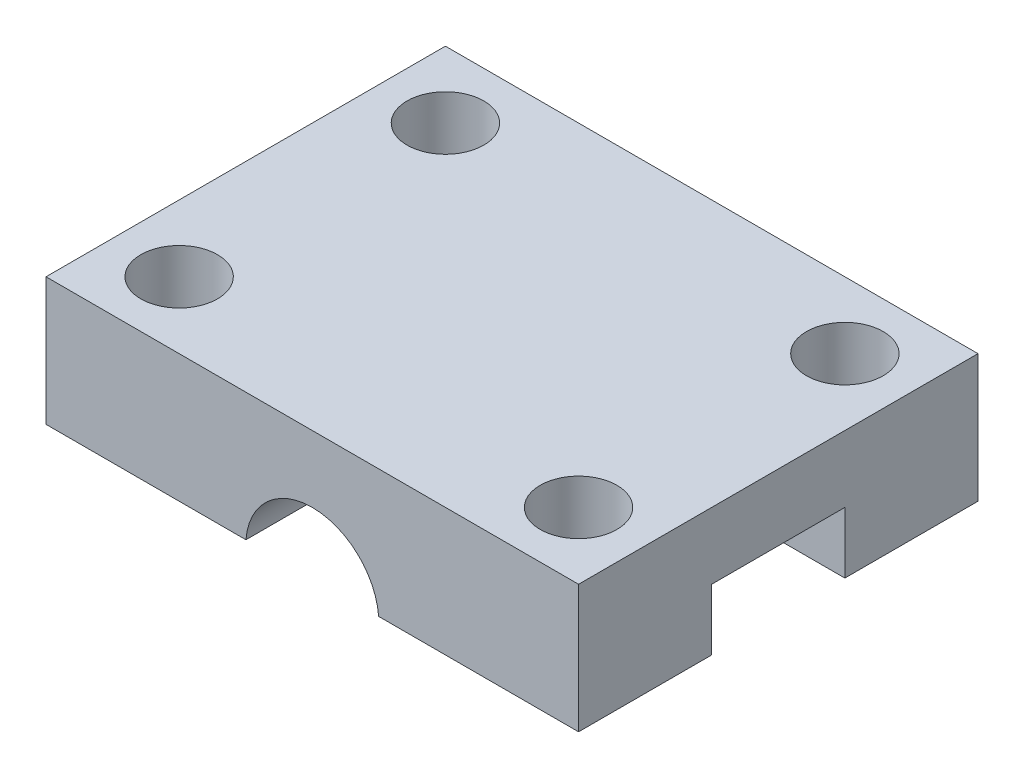
ISO-10303-21;
HEADER;
FILE_DESCRIPTION(('STEP AP214'),'2;1');
FILE_NAME('part.step','',(''),(''),'','','');
FILE_SCHEMA(('AUTOMOTIVE_DESIGN { 1 0 10303 214 1 1 1 1 }'));
ENDSEC;
DATA;
#1=APPLICATION_CONTEXT('core data for automotive mechanical design processes');
#2=APPLICATION_PROTOCOL_DEFINITION('international standard','automotive_design',2000,#1);
#3=PRODUCT_CONTEXT('',#1,'mechanical');
#4=PRODUCT('Part','Part','',(#3));
#5=PRODUCT_RELATED_PRODUCT_CATEGORY('part','',(#4));
#6=PRODUCT_DEFINITION_FORMATION('','',#4);
#7=PRODUCT_DEFINITION_CONTEXT('part definition',#1,'design');
#8=PRODUCT_DEFINITION('design','',#6,#7);
#9=PRODUCT_DEFINITION_SHAPE('','',#8);
#10=(LENGTH_UNIT() NAMED_UNIT(*) SI_UNIT(.MILLI.,.METRE.));
#11=(NAMED_UNIT(*) PLANE_ANGLE_UNIT() SI_UNIT($,.RADIAN.));
#12=(NAMED_UNIT(*) SI_UNIT($,.STERADIAN.) SOLID_ANGLE_UNIT());
#13=UNCERTAINTY_MEASURE_WITH_UNIT(LENGTH_MEASURE(1.E-05),#10,'distance_accuracy_value','');
#14=(GEOMETRIC_REPRESENTATION_CONTEXT(3) GLOBAL_UNCERTAINTY_ASSIGNED_CONTEXT((#13)) GLOBAL_UNIT_ASSIGNED_CONTEXT((#10,
#11,#12)) REPRESENTATION_CONTEXT('',''));
#15=CARTESIAN_POINT('',(0.,0.,0.));
#16=DIRECTION('',(0.,0.,1.));
#17=DIRECTION('',(1.,0.,0.));
#18=AXIS2_PLACEMENT_3D('',#15,#16,#17);
#19=CARTESIAN_POINT('',(25.4,0.,-12.7));
#20=DIRECTION('',(0.,0.,1.));
#21=DIRECTION('',(0.,-1.,0.));
#22=AXIS2_PLACEMENT_3D('',#19,#20,#21);
#23=PLANE('',#22);
#24=CARTESIAN_POINT('',(12.7,-0.254000000000003,-12.7));
#25=DIRECTION('',(0.,0.,1.));
#26=DIRECTION('',(0.,-1.,0.));
#27=AXIS2_PLACEMENT_3D('',#24,#25,#26);
#28=CIRCLE('',#27,3.175);
#29=CARTESIAN_POINT('',(15.8648236917718,0.,-12.7));
#30=VERTEX_POINT('',#29);
#31=CARTESIAN_POINT('',(12.7,2.921,-12.7));
#32=VERTEX_POINT('',#31);
#33=EDGE_CURVE('E157',#30,#32,#28,.T.);
#34=ORIENTED_EDGE('',*,*,#33,.F.);
#35=DIRECTION('',(-1.,0.,0.));
#36=VECTOR('',#35,1.);
#37=CARTESIAN_POINT('',(25.4,0.,-12.7));
#38=LINE('',#37,#36);
#39=CARTESIAN_POINT('',(25.4,0.,-12.7));
#40=VERTEX_POINT('',#39);
#41=EDGE_CURVE('E13',#40,#30,#38,.T.);
#42=ORIENTED_EDGE('',*,*,#41,.F.);
#43=DIRECTION('',(0.,1.,0.));
#44=VECTOR('',#43,1.);
#45=CARTESIAN_POINT('',(25.4,0.,-12.7));
#46=LINE('',#45,#44);
#47=CARTESIAN_POINT('',(25.4,2.921,-12.7));
#48=VERTEX_POINT('',#47);
#49=EDGE_CURVE('E188',#40,#48,#46,.T.);
#50=ORIENTED_EDGE('',*,*,#49,.T.);
#51=DIRECTION('',(-1.,0.,0.));
#52=VECTOR('',#51,1.);
#53=CARTESIAN_POINT('',(25.4,2.921,-12.7));
#54=LINE('',#53,#52);
#55=EDGE_CURVE('E181',#48,#32,#54,.T.);
#56=ORIENTED_EDGE('',*,*,#55,.T.);
#57=EDGE_LOOP('',(#34,#42,#50,#56));
#58=FACE_BOUND('',#57,.T.);
#59=ADVANCED_FACE('F48',(#58),#23,.T.);
#60=CARTESIAN_POINT('',(25.4,0.,0.));
#61=DIRECTION('',(0.,1.,0.));
#62=DIRECTION('',(0.,0.,1.));
#63=AXIS2_PLACEMENT_3D('',#60,#61,#62);
#64=PLANE('',#63);
#65=CARTESIAN_POINT('',(3.175,0.,-15.875));
#66=DIRECTION('',(0.,-1.,0.));
#67=DIRECTION('',(0.,0.,-1.));
#68=AXIS2_PLACEMENT_3D('',#65,#66,#67);
#69=CIRCLE('',#68,1.82879999999999);
#70=CARTESIAN_POINT('',(3.175,0.,-17.7038));
#71=VERTEX_POINT('',#70);
#72=EDGE_CURVE('E242',#71,#71,#69,.T.);
#73=ORIENTED_EDGE('',*,*,#72,.F.);
#74=EDGE_LOOP('',(#73));
#75=FACE_BOUND('',#74,.T.);
#76=DIRECTION('',(-1.,0.,0.));
#77=VECTOR('',#76,1.);
#78=CARTESIAN_POINT('',(25.4,0.,-19.05));
#79=LINE('',#78,#77);
#80=CARTESIAN_POINT('',(9.53517630822821,0.,-19.05));
#81=VERTEX_POINT('',#80);
#82=CARTESIAN_POINT('',(0.,0.,-19.05));
#83=VERTEX_POINT('',#82);
#84=EDGE_CURVE('E163',#81,#83,#79,.T.);
#85=ORIENTED_EDGE('',*,*,#84,.F.);
#86=DIRECTION('',(0.,0.,1.));
#87=VECTOR('',#86,1.);
#88=CARTESIAN_POINT('',(9.53517630822821,0.,-19.05));
#89=LINE('',#88,#87);
#90=CARTESIAN_POINT('',(9.53517630822821,0.,-12.7));
#91=VERTEX_POINT('',#90);
#92=EDGE_CURVE('E63',#81,#91,#89,.T.);
#93=ORIENTED_EDGE('',*,*,#92,.T.);
#94=CARTESIAN_POINT('',(0.,0.,-12.7));
#95=VERTEX_POINT('',#94);
#96=EDGE_CURVE('E56',#91,#95,#38,.T.);
#97=ORIENTED_EDGE('',*,*,#96,.T.);
#98=DIRECTION('',(0.,0.,-1.));
#99=VECTOR('',#98,1.);
#100=CARTESIAN_POINT('',(0.,0.,0.));
#101=LINE('',#100,#99);
#102=EDGE_CURVE('E202',#95,#83,#101,.T.);
#103=ORIENTED_EDGE('',*,*,#102,.T.);
#104=EDGE_LOOP('',(#85,#93,#97,#103));
#105=FACE_BOUND('',#104,.T.);
#106=ADVANCED_FACE('F288',(#75,#105),#64,.F.);
#107=CARTESIAN_POINT('',(3.175,0.,-3.175));
#108=DIRECTION('',(0.,-1.,0.));
#109=DIRECTION('',(0.,0.,-1.));
#110=AXIS2_PLACEMENT_3D('',#107,#108,#109);
#111=CIRCLE('',#110,1.8288);
#112=CARTESIAN_POINT('',(3.175,0.,-5.0038));
#113=VERTEX_POINT('',#112);
#114=EDGE_CURVE('E236',#113,#113,#111,.T.);
#115=ORIENTED_EDGE('',*,*,#114,.F.);
#116=EDGE_LOOP('',(#115));
#117=FACE_BOUND('',#116,.T.);
#118=DIRECTION('',(-1.,0.,0.));
#119=VECTOR('',#118,1.);
#120=CARTESIAN_POINT('',(25.4,0.,-6.35));
#121=LINE('',#120,#119);
#122=CARTESIAN_POINT('',(9.53517630822821,0.,-6.35));
#123=VERTEX_POINT('',#122);
#124=CARTESIAN_POINT('',(0.,0.,-6.35));
#125=VERTEX_POINT('',#124);
#126=EDGE_CURVE('E176',#123,#125,#121,.T.);
#127=ORIENTED_EDGE('',*,*,#126,.F.);
#128=DIRECTION('',(0.,0.,1.));
#129=VECTOR('',#128,1.);
#130=CARTESIAN_POINT('',(9.53517630822821,0.,-19.05));
#131=LINE('',#130,#129);
#132=CARTESIAN_POINT('',(9.53517630822821,0.,0.));
#133=VERTEX_POINT('',#132);
#134=EDGE_CURVE('E71',#123,#133,#131,.T.);
#135=ORIENTED_EDGE('',*,*,#134,.T.);
#136=DIRECTION('',(-1.,0.,0.));
#137=VECTOR('',#136,1.);
#138=CARTESIAN_POINT('',(25.4,0.,0.));
#139=LINE('',#138,#137);
#140=CARTESIAN_POINT('',(0.,0.,0.));
#141=VERTEX_POINT('',#140);
#142=EDGE_CURVE('E172',#133,#141,#139,.T.);
#143=ORIENTED_EDGE('',*,*,#142,.T.);
#144=EDGE_CURVE('E192',#141,#125,#101,.T.);
#145=ORIENTED_EDGE('',*,*,#144,.T.);
#146=EDGE_LOOP('',(#127,#135,#143,#145));
#147=FACE_BOUND('',#146,.T.);
#148=ADVANCED_FACE('F273',(#117,#147),#64,.F.);
#149=CARTESIAN_POINT('',(25.4,0.,-6.35));
#150=DIRECTION('',(0.,0.,-1.));
#151=DIRECTION('',(0.,1.,0.));
#152=AXIS2_PLACEMENT_3D('',#149,#150,#151);
#153=PLANE('',#152);
#154=CARTESIAN_POINT('',(12.7,-0.254000000000003,-6.35));
#155=DIRECTION('',(0.,0.,-1.));
#156=DIRECTION('',(0.,1.,0.));
#157=AXIS2_PLACEMENT_3D('',#154,#155,#156);
#158=CIRCLE('',#157,3.175);
#159=CARTESIAN_POINT('',(12.7,2.921,-6.35));
#160=VERTEX_POINT('',#159);
#161=CARTESIAN_POINT('',(15.8648236917718,0.,-6.35));
#162=VERTEX_POINT('',#161);
#163=EDGE_CURVE('E228',#160,#162,#158,.T.);
#164=ORIENTED_EDGE('',*,*,#163,.F.);
#165=DIRECTION('',(-1.,0.,0.));
#166=VECTOR('',#165,1.);
#167=CARTESIAN_POINT('',(25.4,2.921,-6.35));
#168=LINE('',#167,#166);
#169=CARTESIAN_POINT('',(25.4,2.921,-6.35));
#170=VERTEX_POINT('',#169);
#171=EDGE_CURVE('E177',#170,#160,#168,.T.);
#172=ORIENTED_EDGE('',*,*,#171,.F.);
#173=DIRECTION('',(0.,-1.,0.));
#174=VECTOR('',#173,1.);
#175=CARTESIAN_POINT('',(25.4,0.,-6.35));
#176=LINE('',#175,#174);
#177=CARTESIAN_POINT('',(25.4,0.,-6.35));
#178=VERTEX_POINT('',#177);
#179=EDGE_CURVE('E211',#170,#178,#176,.T.);
#180=ORIENTED_EDGE('',*,*,#179,.T.);
#181=EDGE_CURVE('E173',#178,#162,#121,.T.);
#182=ORIENTED_EDGE('',*,*,#181,.T.);
#183=EDGE_LOOP('',(#164,#172,#180,#182));
#184=FACE_BOUND('',#183,.T.);
#185=ADVANCED_FACE('F280',(#184),#153,.T.);
#186=EDGE_CURVE('E230',#32,#91,#28,.T.);
#187=ORIENTED_EDGE('',*,*,#186,.F.);
#188=CARTESIAN_POINT('',(0.,2.921,-12.7));
#189=VERTEX_POINT('',#188);
#190=EDGE_CURVE('E184',#32,#189,#54,.T.);
#191=ORIENTED_EDGE('',*,*,#190,.T.);
#192=DIRECTION('',(0.,1.,0.));
#193=VECTOR('',#192,1.);
#194=CARTESIAN_POINT('',(0.,0.,-12.7));
#195=LINE('',#194,#193);
#196=EDGE_CURVE('E205',#95,#189,#195,.T.);
#197=ORIENTED_EDGE('',*,*,#196,.F.);
#198=ORIENTED_EDGE('',*,*,#96,.F.);
#199=EDGE_LOOP('',(#187,#191,#197,#198));
#200=FACE_BOUND('',#199,.T.);
#201=ADVANCED_FACE('F50',(#200),#23,.T.);
#202=CARTESIAN_POINT('',(22.225,0.,-15.875));
#203=DIRECTION('',(0.,-1.,0.));
#204=DIRECTION('',(0.,0.,-1.));
#205=AXIS2_PLACEMENT_3D('',#202,#203,#204);
#206=CIRCLE('',#205,1.8288);
#207=CARTESIAN_POINT('',(22.225,0.,-17.7038));
#208=VERTEX_POINT('',#207);
#209=EDGE_CURVE('E254',#208,#208,#206,.T.);
#210=ORIENTED_EDGE('',*,*,#209,.F.);
#211=EDGE_LOOP('',(#210));
#212=FACE_BOUND('',#211,.T.);
#213=ORIENTED_EDGE('',*,*,#41,.T.);
#214=DIRECTION('',(0.,0.,1.));
#215=VECTOR('',#214,1.);
#216=CARTESIAN_POINT('',(15.8648236917718,0.,-19.05));
#217=LINE('',#216,#215);
#218=CARTESIAN_POINT('',(15.8648236917718,0.,-19.05));
#219=VERTEX_POINT('',#218);
#220=EDGE_CURVE('E143',#30,#219,#217,.F.);
#221=ORIENTED_EDGE('',*,*,#220,.T.);
#222=CARTESIAN_POINT('',(25.4,0.,-19.05));
#223=VERTEX_POINT('',#222);
#224=EDGE_CURVE('E155',#223,#219,#79,.T.);
#225=ORIENTED_EDGE('',*,*,#224,.F.);
#226=DIRECTION('',(0.,0.,-1.));
#227=VECTOR('',#226,1.);
#228=CARTESIAN_POINT('',(25.4,0.,0.));
#229=LINE('',#228,#227);
#230=EDGE_CURVE('E222',#40,#223,#229,.T.);
#231=ORIENTED_EDGE('',*,*,#230,.F.);
#232=EDGE_LOOP('',(#213,#221,#225,#231));
#233=FACE_BOUND('',#232,.T.);
#234=ADVANCED_FACE('F153',(#212,#233),#64,.F.);
#235=CARTESIAN_POINT('',(25.4,0.,-19.05));
#236=DIRECTION('',(0.,0.,1.));
#237=DIRECTION('',(1.,0.,0.));
#238=AXIS2_PLACEMENT_3D('',#235,#236,#237);
#239=PLANE('',#238);
#240=ORIENTED_EDGE('',*,*,#224,.T.);
#241=CARTESIAN_POINT('',(12.7,-0.254000000000003,-19.05));
#242=DIRECTION('',(0.,0.,1.));
#243=DIRECTION('',(1.,0.,0.));
#244=AXIS2_PLACEMENT_3D('',#241,#242,#243);
#245=CIRCLE('',#244,3.175);
#246=EDGE_CURVE('E140',#219,#81,#245,.T.);
#247=ORIENTED_EDGE('',*,*,#246,.T.);
#248=ORIENTED_EDGE('',*,*,#84,.T.);
#249=DIRECTION('',(0.,1.,0.));
#250=VECTOR('',#249,1.);
#251=CARTESIAN_POINT('',(0.,0.,-19.05));
#252=LINE('',#251,#250);
#253=CARTESIAN_POINT('',(0.,6.096,-19.05));
#254=VERTEX_POINT('',#253);
#255=EDGE_CURVE('E199',#83,#254,#252,.T.);
#256=ORIENTED_EDGE('',*,*,#255,.T.);
#257=DIRECTION('',(-1.,0.,0.));
#258=VECTOR('',#257,1.);
#259=CARTESIAN_POINT('',(25.4,6.096,-19.05));
#260=LINE('',#259,#258);
#261=CARTESIAN_POINT('',(25.4,6.096,-19.05));
#262=VERTEX_POINT('',#261);
#263=EDGE_CURVE('E164',#262,#254,#260,.T.);
#264=ORIENTED_EDGE('',*,*,#263,.F.);
#265=DIRECTION('',(0.,1.,0.));
#266=VECTOR('',#265,1.);
#267=CARTESIAN_POINT('',(25.4,0.,-19.05));
#268=LINE('',#267,#266);
#269=EDGE_CURVE('E162',#223,#262,#268,.T.);
#270=ORIENTED_EDGE('',*,*,#269,.F.);
#271=EDGE_LOOP('',(#240,#247,#248,#256,#264,#270));
#272=FACE_BOUND('',#271,.T.);
#273=ADVANCED_FACE('F160',(#272),#239,.F.);
#274=CARTESIAN_POINT('',(25.4,6.096,0.));
#275=DIRECTION('',(0.,1.,0.));
#276=DIRECTION('',(0.,0.,1.));
#277=AXIS2_PLACEMENT_3D('',#274,#275,#276);
#278=PLANE('',#277);
#279=CARTESIAN_POINT('',(22.225,6.096,-15.875));
#280=DIRECTION('',(0.,-1.,0.));
#281=DIRECTION('',(0.,0.,-1.));
#282=AXIS2_PLACEMENT_3D('',#279,#280,#281);
#283=CIRCLE('',#282,1.8288);
#284=CARTESIAN_POINT('',(22.225,6.096,-17.7038));
#285=VERTEX_POINT('',#284);
#286=EDGE_CURVE('E251',#285,#285,#283,.T.);
#287=ORIENTED_EDGE('',*,*,#286,.T.);
#288=EDGE_LOOP('',(#287));
#289=FACE_BOUND('',#288,.T.);
#290=CARTESIAN_POINT('',(22.225,6.096,-3.175));
#291=DIRECTION('',(0.,-1.,0.));
#292=DIRECTION('',(0.,0.,-1.));
#293=AXIS2_PLACEMENT_3D('',#290,#291,#292);
#294=CIRCLE('',#293,1.82880000000001);
#295=CARTESIAN_POINT('',(22.225,6.096,-5.00380000000001));
#296=VERTEX_POINT('',#295);
#297=EDGE_CURVE('E245',#296,#296,#294,.T.);
#298=ORIENTED_EDGE('',*,*,#297,.T.);
#299=EDGE_LOOP('',(#298));
#300=FACE_BOUND('',#299,.T.);
#301=CARTESIAN_POINT('',(3.175,6.096,-15.875));
#302=DIRECTION('',(0.,-1.,0.));
#303=DIRECTION('',(0.,0.,-1.));
#304=AXIS2_PLACEMENT_3D('',#301,#302,#303);
#305=CIRCLE('',#304,1.82879999999999);
#306=CARTESIAN_POINT('',(3.175,6.096,-17.7038));
#307=VERTEX_POINT('',#306);
#308=EDGE_CURVE('E239',#307,#307,#305,.T.);
#309=ORIENTED_EDGE('',*,*,#308,.T.);
#310=EDGE_LOOP('',(#309));
#311=FACE_BOUND('',#310,.T.);
#312=CARTESIAN_POINT('',(3.175,6.096,-3.175));
#313=DIRECTION('',(0.,-1.,0.));
#314=DIRECTION('',(0.,0.,-1.));
#315=AXIS2_PLACEMENT_3D('',#312,#313,#314);
#316=CIRCLE('',#315,1.8288);
#317=CARTESIAN_POINT('',(3.175,6.096,-5.0038));
#318=VERTEX_POINT('',#317);
#319=EDGE_CURVE('E234',#318,#318,#316,.T.);
#320=ORIENTED_EDGE('',*,*,#319,.T.);
#321=EDGE_LOOP('',(#320));
#322=FACE_BOUND('',#321,.T.);
#323=DIRECTION('',(0.,0.,-1.));
#324=VECTOR('',#323,1.);
#325=CARTESIAN_POINT('',(0.,6.096,0.));
#326=LINE('',#325,#324);
#327=CARTESIAN_POINT('',(0.,6.096,0.));
#328=VERTEX_POINT('',#327);
#329=EDGE_CURVE('E196',#328,#254,#326,.T.);
#330=ORIENTED_EDGE('',*,*,#329,.F.);
#331=DIRECTION('',(-1.,0.,0.));
#332=VECTOR('',#331,1.);
#333=CARTESIAN_POINT('',(25.4,6.096,0.));
#334=LINE('',#333,#332);
#335=CARTESIAN_POINT('',(25.4,6.096,0.));
#336=VERTEX_POINT('',#335);
#337=EDGE_CURVE('E167',#336,#328,#334,.T.);
#338=ORIENTED_EDGE('',*,*,#337,.F.);
#339=DIRECTION('',(0.,0.,-1.));
#340=VECTOR('',#339,1.);
#341=CARTESIAN_POINT('',(25.4,6.096,0.));
#342=LINE('',#341,#340);
#343=EDGE_CURVE('E218',#336,#262,#342,.T.);
#344=ORIENTED_EDGE('',*,*,#343,.T.);
#345=ORIENTED_EDGE('',*,*,#263,.T.);
#346=EDGE_LOOP('',(#330,#338,#344,#345));
#347=FACE_BOUND('',#346,.T.);
#348=ADVANCED_FACE('F260',(#289,#300,#311,#322,#347),#278,.T.);
#349=CARTESIAN_POINT('',(25.4,0.,0.));
#350=DIRECTION('',(0.,0.,1.));
#351=DIRECTION('',(1.,0.,0.));
#352=AXIS2_PLACEMENT_3D('',#349,#350,#351);
#353=PLANE('',#352);
#354=CARTESIAN_POINT('',(12.7,-0.254000000000003,0.));
#355=DIRECTION('',(0.,0.,1.));
#356=DIRECTION('',(1.,0.,0.));
#357=AXIS2_PLACEMENT_3D('',#354,#355,#356);
#358=CIRCLE('',#357,3.175);
#359=CARTESIAN_POINT('',(15.8648236917718,0.,0.));
#360=VERTEX_POINT('',#359);
#361=EDGE_CURVE('E149',#360,#133,#358,.T.);
#362=ORIENTED_EDGE('',*,*,#361,.F.);
#363=CARTESIAN_POINT('',(25.4,0.,0.));
#364=VERTEX_POINT('',#363);
#365=EDGE_CURVE('E169',#364,#360,#139,.T.);
#366=ORIENTED_EDGE('',*,*,#365,.F.);
#367=DIRECTION('',(0.,1.,0.));
#368=VECTOR('',#367,1.);
#369=CARTESIAN_POINT('',(25.4,0.,0.));
#370=LINE('',#369,#368);
#371=EDGE_CURVE('E215',#364,#336,#370,.T.);
#372=ORIENTED_EDGE('',*,*,#371,.T.);
#373=ORIENTED_EDGE('',*,*,#337,.T.);
#374=DIRECTION('',(0.,1.,0.));
#375=VECTOR('',#374,1.);
#376=CARTESIAN_POINT('',(0.,0.,0.));
#377=LINE('',#376,#375);
#378=EDGE_CURVE('E193',#141,#328,#377,.T.);
#379=ORIENTED_EDGE('',*,*,#378,.F.);
#380=ORIENTED_EDGE('',*,*,#142,.F.);
#381=EDGE_LOOP('',(#362,#366,#372,#373,#379,#380));
#382=FACE_BOUND('',#381,.T.);
#383=ADVANCED_FACE('F286',(#382),#353,.T.);
#384=CARTESIAN_POINT('',(22.225,0.,-3.175));
#385=DIRECTION('',(0.,-1.,0.));
#386=DIRECTION('',(0.,0.,-1.));
#387=AXIS2_PLACEMENT_3D('',#384,#385,#386);
#388=CIRCLE('',#387,1.82880000000001);
#389=CARTESIAN_POINT('',(22.225,0.,-5.00380000000001));
#390=VERTEX_POINT('',#389);
#391=EDGE_CURVE('E248',#390,#390,#388,.T.);
#392=ORIENTED_EDGE('',*,*,#391,.F.);
#393=EDGE_LOOP('',(#392));
#394=FACE_BOUND('',#393,.T.);
#395=ORIENTED_EDGE('',*,*,#365,.T.);
#396=DIRECTION('',(0.,0.,1.));
#397=VECTOR('',#396,1.);
#398=CARTESIAN_POINT('',(15.8648236917718,0.,-19.05));
#399=LINE('',#398,#397);
#400=EDGE_CURVE('E158',#360,#162,#399,.F.);
#401=ORIENTED_EDGE('',*,*,#400,.T.);
#402=ORIENTED_EDGE('',*,*,#181,.F.);
#403=EDGE_CURVE('E214',#364,#178,#229,.T.);
#404=ORIENTED_EDGE('',*,*,#403,.F.);
#405=EDGE_LOOP('',(#395,#401,#402,#404));
#406=FACE_BOUND('',#405,.T.);
#407=ADVANCED_FACE('F272',(#394,#406),#64,.F.);
#408=EDGE_CURVE('E148',#123,#160,#158,.T.);
#409=ORIENTED_EDGE('',*,*,#408,.F.);
#410=ORIENTED_EDGE('',*,*,#126,.T.);
#411=DIRECTION('',(0.,-1.,0.));
#412=VECTOR('',#411,1.);
#413=CARTESIAN_POINT('',(0.,0.,-6.35));
#414=LINE('',#413,#412);
#415=CARTESIAN_POINT('',(0.,2.921,-6.35));
#416=VERTEX_POINT('',#415);
#417=EDGE_CURVE('E189',#416,#125,#414,.T.);
#418=ORIENTED_EDGE('',*,*,#417,.F.);
#419=EDGE_CURVE('E180',#160,#416,#168,.T.);
#420=ORIENTED_EDGE('',*,*,#419,.F.);
#421=EDGE_LOOP('',(#409,#410,#418,#420));
#422=FACE_BOUND('',#421,.T.);
#423=ADVANCED_FACE('F285',(#422),#153,.T.);
#424=CARTESIAN_POINT('',(25.4,2.921,0.));
#425=DIRECTION('',(0.,-1.,0.));
#426=DIRECTION('',(0.,0.,-1.));
#427=AXIS2_PLACEMENT_3D('',#424,#425,#426);
#428=PLANE('',#427);
#429=ORIENTED_EDGE('',*,*,#171,.T.);
#430=ORIENTED_EDGE('',*,*,#419,.T.);
#431=DIRECTION('',(0.,0.,1.));
#432=VECTOR('',#431,1.);
#433=CARTESIAN_POINT('',(0.,2.921,0.));
#434=LINE('',#433,#432);
#435=EDGE_CURVE('E185',#189,#416,#434,.T.);
#436=ORIENTED_EDGE('',*,*,#435,.F.);
#437=ORIENTED_EDGE('',*,*,#190,.F.);
#438=ORIENTED_EDGE('',*,*,#55,.F.);
#439=DIRECTION('',(0.,0.,1.));
#440=VECTOR('',#439,1.);
#441=CARTESIAN_POINT('',(25.4,2.921,0.));
#442=LINE('',#441,#440);
#443=EDGE_CURVE('E208',#48,#170,#442,.T.);
#444=ORIENTED_EDGE('',*,*,#443,.T.);
#445=EDGE_LOOP('',(#429,#430,#436,#437,#438,#444));
#446=FACE_BOUND('',#445,.T.);
#447=ADVANCED_FACE('F303',(#446),#428,.T.);
#448=CARTESIAN_POINT('',(25.4,0.,0.));
#449=DIRECTION('',(1.,0.,0.));
#450=DIRECTION('',(0.,0.,-1.));
#451=AXIS2_PLACEMENT_3D('',#448,#449,#450);
#452=PLANE('',#451);
#453=ORIENTED_EDGE('',*,*,#49,.F.);
#454=ORIENTED_EDGE('',*,*,#230,.T.);
#455=ORIENTED_EDGE('',*,*,#269,.T.);
#456=ORIENTED_EDGE('',*,*,#343,.F.);
#457=ORIENTED_EDGE('',*,*,#371,.F.);
#458=ORIENTED_EDGE('',*,*,#403,.T.);
#459=ORIENTED_EDGE('',*,*,#179,.F.);
#460=ORIENTED_EDGE('',*,*,#443,.F.);
#461=EDGE_LOOP('',(#453,#454,#455,#456,#457,#458,#459,#460));
#462=FACE_BOUND('',#461,.T.);
#463=ADVANCED_FACE('F319',(#462),#452,.T.);
#464=CARTESIAN_POINT('',(0.,0.,0.));
#465=DIRECTION('',(1.,0.,0.));
#466=DIRECTION('',(0.,0.,-1.));
#467=AXIS2_PLACEMENT_3D('',#464,#465,#466);
#468=PLANE('',#467);
#469=ORIENTED_EDGE('',*,*,#196,.T.);
#470=ORIENTED_EDGE('',*,*,#435,.T.);
#471=ORIENTED_EDGE('',*,*,#417,.T.);
#472=ORIENTED_EDGE('',*,*,#144,.F.);
#473=ORIENTED_EDGE('',*,*,#378,.T.);
#474=ORIENTED_EDGE('',*,*,#329,.T.);
#475=ORIENTED_EDGE('',*,*,#255,.F.);
#476=ORIENTED_EDGE('',*,*,#102,.F.);
#477=EDGE_LOOP('',(#469,#470,#471,#472,#473,#474,#475,#476));
#478=FACE_BOUND('',#477,.T.);
#479=ADVANCED_FACE('F307',(#478),#468,.F.);
#480=CARTESIAN_POINT('',(12.7,-0.254000000000003,-19.05));
#481=DIRECTION('',(0.,0.,1.));
#482=DIRECTION('',(1.,0.,0.));
#483=AXIS2_PLACEMENT_3D('',#480,#481,#482);
#484=CYLINDRICAL_SURFACE('',#483,3.175);
#485=ORIENTED_EDGE('',*,*,#361,.T.);
#486=ORIENTED_EDGE('',*,*,#134,.F.);
#487=ORIENTED_EDGE('',*,*,#408,.T.);
#488=ORIENTED_EDGE('',*,*,#163,.T.);
#489=ORIENTED_EDGE('',*,*,#400,.F.);
#490=EDGE_LOOP('',(#485,#486,#487,#488,#489));
#491=FACE_BOUND('',#490,.T.);
#492=ADVANCED_FACE('F334',(#491),#484,.F.);
#493=ORIENTED_EDGE('',*,*,#33,.T.);
#494=ORIENTED_EDGE('',*,*,#186,.T.);
#495=ORIENTED_EDGE('',*,*,#92,.F.);
#496=ORIENTED_EDGE('',*,*,#246,.F.);
#497=ORIENTED_EDGE('',*,*,#220,.F.);
#498=EDGE_LOOP('',(#493,#494,#495,#496,#497));
#499=FACE_BOUND('',#498,.T.);
#500=ADVANCED_FACE('F142',(#499),#484,.F.);
#501=CARTESIAN_POINT('',(3.175,6.096,-3.175));
#502=DIRECTION('',(0.,-1.,0.));
#503=DIRECTION('',(0.,0.,-1.));
#504=AXIS2_PLACEMENT_3D('',#501,#502,#503);
#505=CYLINDRICAL_SURFACE('',#504,1.8288);
#506=ORIENTED_EDGE('',*,*,#319,.F.);
#507=EDGE_LOOP('',(#506));
#508=FACE_BOUND('',#507,.T.);
#509=ORIENTED_EDGE('',*,*,#114,.T.);
#510=EDGE_LOOP('',(#509));
#511=FACE_BOUND('',#510,.T.);
#512=ADVANCED_FACE('F341',(#508,#511),#505,.F.);
#513=CARTESIAN_POINT('',(3.175,6.096,-15.875));
#514=DIRECTION('',(0.,-1.,0.));
#515=DIRECTION('',(0.,0.,-1.));
#516=AXIS2_PLACEMENT_3D('',#513,#514,#515);
#517=CYLINDRICAL_SURFACE('',#516,1.82879999999999);
#518=ORIENTED_EDGE('',*,*,#308,.F.);
#519=EDGE_LOOP('',(#518));
#520=FACE_BOUND('',#519,.T.);
#521=ORIENTED_EDGE('',*,*,#72,.T.);
#522=EDGE_LOOP('',(#521));
#523=FACE_BOUND('',#522,.T.);
#524=ADVANCED_FACE('F396',(#520,#523),#517,.F.);
#525=CARTESIAN_POINT('',(22.225,6.096,-3.175));
#526=DIRECTION('',(0.,-1.,0.));
#527=DIRECTION('',(0.,0.,-1.));
#528=AXIS2_PLACEMENT_3D('',#525,#526,#527);
#529=CYLINDRICAL_SURFACE('',#528,1.82880000000001);
#530=ORIENTED_EDGE('',*,*,#297,.F.);
#531=EDGE_LOOP('',(#530));
#532=FACE_BOUND('',#531,.T.);
#533=ORIENTED_EDGE('',*,*,#391,.T.);
#534=EDGE_LOOP('',(#533));
#535=FACE_BOUND('',#534,.T.);
#536=ADVANCED_FACE('F266',(#532,#535),#529,.F.);
#537=CARTESIAN_POINT('',(22.225,6.096,-15.875));
#538=DIRECTION('',(0.,-1.,0.));
#539=DIRECTION('',(0.,0.,-1.));
#540=AXIS2_PLACEMENT_3D('',#537,#538,#539);
#541=CYLINDRICAL_SURFACE('',#540,1.8288);
#542=ORIENTED_EDGE('',*,*,#286,.F.);
#543=EDGE_LOOP('',(#542));
#544=FACE_BOUND('',#543,.T.);
#545=ORIENTED_EDGE('',*,*,#209,.T.);
#546=EDGE_LOOP('',(#545));
#547=FACE_BOUND('',#546,.T.);
#548=ADVANCED_FACE('F263',(#544,#547),#541,.F.);
#549=CLOSED_SHELL('',(#59,#106,#148,#185,#201,#234,#273,#348,#383,#407,#423,#447,#463,#479,#492,
#500,#512,#524,#536,#548));
#550=MANIFOLD_SOLID_BREP('B2',#549);
#551=ADVANCED_BREP_SHAPE_REPRESENTATION('',(#18,#550),#14);
#552=SHAPE_DEFINITION_REPRESENTATION(#9,#551);
ENDSEC;
END-ISO-10303-21;
